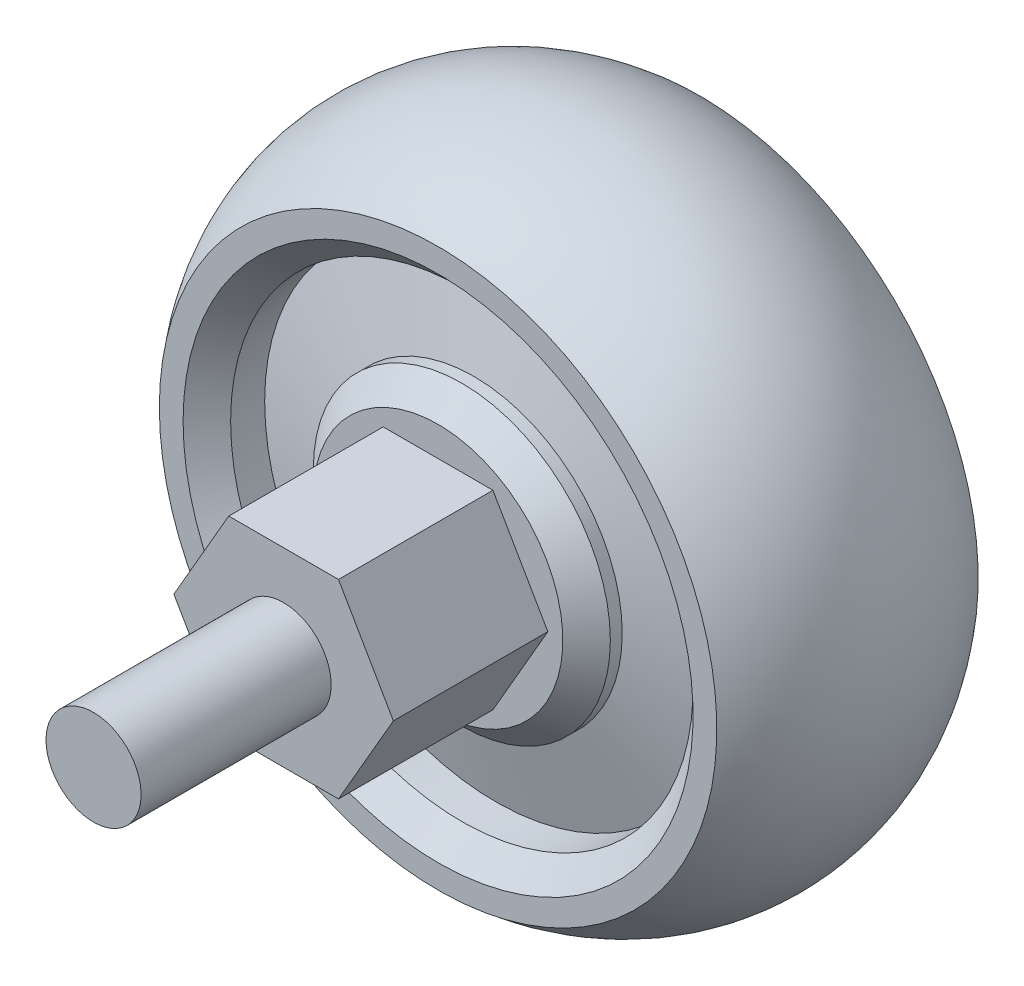
ISO-10303-21;
HEADER;
FILE_DESCRIPTION(('STEP AP214'),'2;1');
FILE_NAME('part.step','',(''),(''),'','','');
FILE_SCHEMA(('AUTOMOTIVE_DESIGN { 1 0 10303 214 1 1 1 1 }'));
ENDSEC;
DATA;
#1=APPLICATION_CONTEXT('core data for automotive mechanical design processes');
#2=APPLICATION_PROTOCOL_DEFINITION('international standard','automotive_design',2000,#1);
#3=PRODUCT_CONTEXT('',#1,'mechanical');
#4=PRODUCT('Part','Part','',(#3));
#5=PRODUCT_RELATED_PRODUCT_CATEGORY('part','',(#4));
#6=PRODUCT_DEFINITION_FORMATION('','',#4);
#7=PRODUCT_DEFINITION_CONTEXT('part definition',#1,'design');
#8=PRODUCT_DEFINITION('design','',#6,#7);
#9=PRODUCT_DEFINITION_SHAPE('','',#8);
#10=(LENGTH_UNIT() NAMED_UNIT(*) SI_UNIT(.MILLI.,.METRE.));
#11=(NAMED_UNIT(*) PLANE_ANGLE_UNIT() SI_UNIT($,.RADIAN.));
#12=(NAMED_UNIT(*) SI_UNIT($,.STERADIAN.) SOLID_ANGLE_UNIT());
#13=UNCERTAINTY_MEASURE_WITH_UNIT(LENGTH_MEASURE(1.E-05),#10,'distance_accuracy_value','');
#14=(GEOMETRIC_REPRESENTATION_CONTEXT(3) GLOBAL_UNCERTAINTY_ASSIGNED_CONTEXT((#13)) GLOBAL_UNIT_ASSIGNED_CONTEXT((#10,
#11,#12)) REPRESENTATION_CONTEXT('',''));
#15=CARTESIAN_POINT('',(0.,0.,0.));
#16=DIRECTION('',(0.,0.,1.));
#17=DIRECTION('',(1.,0.,0.));
#18=AXIS2_PLACEMENT_3D('',#15,#16,#17);
#19=CARTESIAN_POINT('',(0.,0.,7.79103938563071));
#20=DIRECTION('',(0.,0.,-1.));
#21=DIRECTION('',(-1.,0.,0.));
#22=AXIS2_PLACEMENT_3D('',#19,#20,#21);
#23=CONICAL_SURFACE('',#22,24.716081373956,1.30899693899575);
#24=CARTESIAN_POINT('',(0.,0.,10.16));
#25=DIRECTION('',(0.,0.,-1.));
#26=DIRECTION('',(-1.,0.,0.));
#27=AXIS2_PLACEMENT_3D('',#24,#25,#26);
#28=CIRCLE('',#27,15.875);
#29=CARTESIAN_POINT('',(-15.875,0.,10.16));
#30=VERTEX_POINT('',#29);
#31=EDGE_CURVE('E128',#30,#30,#28,.T.);
#32=ORIENTED_EDGE('',*,*,#31,.T.);
#33=EDGE_LOOP('',(#32));
#34=FACE_BOUND('',#33,.T.);
#35=CARTESIAN_POINT('',(0.,0.,7.79103938563071));
#36=DIRECTION('',(0.,0.,-1.));
#37=DIRECTION('',(-1.,0.,0.));
#38=AXIS2_PLACEMENT_3D('',#35,#36,#37);
#39=CIRCLE('',#38,24.716081373956);
#40=CARTESIAN_POINT('',(-24.716081373956,0.,7.79103938563071));
#41=VERTEX_POINT('',#40);
#42=EDGE_CURVE('E131',#41,#41,#39,.T.);
#43=ORIENTED_EDGE('',*,*,#42,.F.);
#44=EDGE_LOOP('',(#43));
#45=FACE_BOUND('',#44,.T.);
#46=ADVANCED_FACE('F16',(#34,#45),#23,.T.);
#47=CARTESIAN_POINT('',(0.,0.,0.));
#48=DIRECTION('',(0.,0.,-1.));
#49=DIRECTION('',(-1.,0.,0.));
#50=AXIS2_PLACEMENT_3D('',#47,#48,#49);
#51=CYLINDRICAL_SURFACE('',#50,15.875);
#52=CARTESIAN_POINT('',(0.,0.,11.43));
#53=DIRECTION('',(0.,0.,-1.));
#54=DIRECTION('',(-1.,0.,0.));
#55=AXIS2_PLACEMENT_3D('',#52,#53,#54);
#56=CIRCLE('',#55,15.875);
#57=CARTESIAN_POINT('',(-15.875,0.,11.43));
#58=VERTEX_POINT('',#57);
#59=EDGE_CURVE('E11',#58,#58,#56,.T.);
#60=ORIENTED_EDGE('',*,*,#59,.T.);
#61=EDGE_LOOP('',(#60));
#62=FACE_BOUND('',#61,.T.);
#63=ORIENTED_EDGE('',*,*,#31,.F.);
#64=EDGE_LOOP('',(#63));
#65=FACE_BOUND('',#64,.T.);
#66=ADVANCED_FACE('F171',(#62,#65),#51,.T.);
#67=CARTESIAN_POINT('',(0.,0.,0.));
#68=DIRECTION('',(0.,0.,-1.));
#69=DIRECTION('',(-1.,0.,0.));
#70=AXIS2_PLACEMENT_3D('',#67,#68,#69);
#71=CYLINDRICAL_SURFACE('',#70,24.716081373956);
#72=CARTESIAN_POINT('',(0.,0.,-11.43));
#73=DIRECTION('',(0.,0.,1.));
#74=DIRECTION('',(1.,0.,0.));
#75=AXIS2_PLACEMENT_3D('',#72,#73,#74);
#76=CIRCLE('',#75,24.716081373956);
#77=CARTESIAN_POINT('',(24.716081373956,0.,-11.43));
#78=VERTEX_POINT('',#77);
#79=EDGE_CURVE('E137',#78,#78,#76,.F.);
#80=ORIENTED_EDGE('',*,*,#79,.T.);
#81=EDGE_LOOP('',(#80));
#82=FACE_BOUND('',#81,.T.);
#83=CARTESIAN_POINT('',(0.,0.,-7.79103938563071));
#84=DIRECTION('',(0.,0.,1.));
#85=DIRECTION('',(1.,0.,0.));
#86=AXIS2_PLACEMENT_3D('',#83,#84,#85);
#87=CIRCLE('',#86,24.716081373956);
#88=CARTESIAN_POINT('',(24.716081373956,0.,-7.79103938563071));
#89=VERTEX_POINT('',#88);
#90=EDGE_CURVE('E119',#89,#89,#87,.F.);
#91=ORIENTED_EDGE('',*,*,#90,.F.);
#92=EDGE_LOOP('',(#91));
#93=FACE_BOUND('',#92,.T.);
#94=ADVANCED_FACE('F178',(#82,#93),#71,.F.);
#95=CARTESIAN_POINT('',(0.,0.,0.));
#96=DIRECTION('',(0.,0.,-1.));
#97=DIRECTION('',(-1.,0.,0.));
#98=AXIS2_PLACEMENT_3D('',#95,#96,#97);
#99=DEGENERATE_TOROIDAL_SURFACE('',#98,13.335,21.59,.T.);
#100=CARTESIAN_POINT('',(0.,0.,-13.97));
#101=DIRECTION('',(0.,0.,-1.));
#102=DIRECTION('',(-1.,0.,0.));
#103=AXIS2_PLACEMENT_3D('',#100,#101,#102);
#104=CIRCLE('',#103,29.7960813739559);
#105=CARTESIAN_POINT('',(-29.7960813739559,0.,-13.97));
#106=VERTEX_POINT('',#105);
#107=EDGE_CURVE('E98',#106,#106,#104,.T.);
#108=ORIENTED_EDGE('',*,*,#107,.F.);
#109=EDGE_LOOP('',(#108));
#110=FACE_BOUND('',#109,.T.);
#111=CARTESIAN_POINT('',(0.,0.,13.97));
#112=DIRECTION('',(0.,0.,-1.));
#113=DIRECTION('',(-1.,0.,0.));
#114=AXIS2_PLACEMENT_3D('',#111,#112,#113);
#115=CIRCLE('',#114,29.7960813739559);
#116=CARTESIAN_POINT('',(-29.7960813739559,0.,13.97));
#117=VERTEX_POINT('',#116);
#118=EDGE_CURVE('E116',#117,#117,#115,.T.);
#119=ORIENTED_EDGE('',*,*,#118,.T.);
#120=EDGE_LOOP('',(#119));
#121=FACE_BOUND('',#120,.T.);
#122=ADVANCED_FACE('F221',(#110,#121),#99,.T.);
#123=CARTESIAN_POINT('',(0.,0.,13.97));
#124=DIRECTION('',(0.,0.,-1.));
#125=DIRECTION('',(-1.,0.,0.));
#126=AXIS2_PLACEMENT_3D('',#123,#124,#125);
#127=PLANE('',#126);
#128=CARTESIAN_POINT('',(0.,0.,13.97));
#129=DIRECTION('',(0.,0.,-1.));
#130=DIRECTION('',(-1.,0.,0.));
#131=AXIS2_PLACEMENT_3D('',#128,#129,#130);
#132=CIRCLE('',#131,27.2560813739559);
#133=CARTESIAN_POINT('',(-27.2560813739559,0.,13.97));
#134=VERTEX_POINT('',#133);
#135=EDGE_CURVE('E149',#134,#134,#132,.T.);
#136=ORIENTED_EDGE('',*,*,#135,.T.);
#137=EDGE_LOOP('',(#136));
#138=FACE_BOUND('',#137,.T.);
#139=ORIENTED_EDGE('',*,*,#118,.F.);
#140=EDGE_LOOP('',(#139));
#141=FACE_BOUND('',#140,.T.);
#142=ADVANCED_FACE('F270',(#138,#141),#127,.F.);
#143=CARTESIAN_POINT('',(0.,0.,11.43));
#144=DIRECTION('',(0.,0.,-1.));
#145=DIRECTION('',(-1.,0.,0.));
#146=AXIS2_PLACEMENT_3D('',#143,#144,#145);
#147=CIRCLE('',#146,24.716081373956);
#148=CARTESIAN_POINT('',(-24.716081373956,0.,11.43));
#149=VERTEX_POINT('',#148);
#150=EDGE_CURVE('E152',#149,#149,#147,.F.);
#151=ORIENTED_EDGE('',*,*,#150,.T.);
#152=EDGE_LOOP('',(#151));
#153=FACE_BOUND('',#152,.T.);
#154=ORIENTED_EDGE('',*,*,#42,.T.);
#155=EDGE_LOOP('',(#154));
#156=FACE_BOUND('',#155,.T.);
#157=ADVANCED_FACE('F216',(#153,#156),#71,.F.);
#158=CARTESIAN_POINT('',(0.,0.,-13.97));
#159=DIRECTION('',(0.,0.,1.));
#160=DIRECTION('',(1.,0.,0.));
#161=AXIS2_PLACEMENT_3D('',#158,#159,#160);
#162=PLANE('',#161);
#163=CARTESIAN_POINT('',(0.,0.,-13.97));
#164=DIRECTION('',(0.,0.,1.));
#165=DIRECTION('',(1.,0.,0.));
#166=AXIS2_PLACEMENT_3D('',#163,#164,#165);
#167=CIRCLE('',#166,27.2560813739559);
#168=CARTESIAN_POINT('',(27.2560813739559,0.,-13.97));
#169=VERTEX_POINT('',#168);
#170=EDGE_CURVE('E140',#169,#169,#167,.T.);
#171=ORIENTED_EDGE('',*,*,#170,.T.);
#172=EDGE_LOOP('',(#171));
#173=FACE_BOUND('',#172,.T.);
#174=ORIENTED_EDGE('',*,*,#107,.T.);
#175=EDGE_LOOP('',(#174));
#176=FACE_BOUND('',#175,.T.);
#177=ADVANCED_FACE('F209',(#173,#176),#162,.F.);
#178=CARTESIAN_POINT('',(0.,0.,-13.97));
#179=DIRECTION('',(0.,0.,-1.));
#180=DIRECTION('',(-1.,0.,0.));
#181=AXIS2_PLACEMENT_3D('',#178,#179,#180);
#182=PLANE('',#181);
#183=CARTESIAN_POINT('',(0.,0.,-13.97));
#184=DIRECTION('',(0.,0.,-1.));
#185=DIRECTION('',(-1.,0.,0.));
#186=AXIS2_PLACEMENT_3D('',#183,#184,#185);
#187=CIRCLE('',#186,13.335);
#188=CARTESIAN_POINT('',(-13.335,0.,-13.97));
#189=VERTEX_POINT('',#188);
#190=EDGE_CURVE('E143',#189,#189,#187,.T.);
#191=ORIENTED_EDGE('',*,*,#190,.T.);
#192=EDGE_LOOP('',(#191));
#193=FACE_BOUND('',#192,.T.);
#194=ADVANCED_FACE('F191',(#193),#182,.T.);
#195=CARTESIAN_POINT('',(0.,0.,0.));
#196=DIRECTION('',(0.,0.,-1.));
#197=DIRECTION('',(-1.,0.,0.));
#198=AXIS2_PLACEMENT_3D('',#195,#196,#197);
#199=CYLINDRICAL_SURFACE('',#198,15.875);
#200=CARTESIAN_POINT('',(0.,0.,-11.43));
#201=DIRECTION('',(0.,0.,-1.));
#202=DIRECTION('',(-1.,0.,0.));
#203=AXIS2_PLACEMENT_3D('',#200,#201,#202);
#204=CIRCLE('',#203,15.875);
#205=CARTESIAN_POINT('',(-15.875,0.,-11.43));
#206=VERTEX_POINT('',#205);
#207=EDGE_CURVE('E146',#206,#206,#204,.F.);
#208=ORIENTED_EDGE('',*,*,#207,.T.);
#209=EDGE_LOOP('',(#208));
#210=FACE_BOUND('',#209,.T.);
#211=CARTESIAN_POINT('',(0.,0.,-10.16));
#212=DIRECTION('',(0.,0.,-1.));
#213=DIRECTION('',(-1.,0.,0.));
#214=AXIS2_PLACEMENT_3D('',#211,#212,#213);
#215=CIRCLE('',#214,15.875);
#216=CARTESIAN_POINT('',(-15.875,0.,-10.16));
#217=VERTEX_POINT('',#216);
#218=EDGE_CURVE('E134',#217,#217,#215,.T.);
#219=ORIENTED_EDGE('',*,*,#218,.T.);
#220=EDGE_LOOP('',(#219));
#221=FACE_BOUND('',#220,.T.);
#222=ADVANCED_FACE('F187',(#210,#221),#199,.T.);
#223=CARTESIAN_POINT('',(0.,0.,-10.16));
#224=DIRECTION('',(0.,0.,1.));
#225=DIRECTION('',(1.,0.,0.));
#226=AXIS2_PLACEMENT_3D('',#223,#224,#225);
#227=CONICAL_SURFACE('',#226,15.875,1.30899693899575);
#228=ORIENTED_EDGE('',*,*,#90,.T.);
#229=EDGE_LOOP('',(#228));
#230=FACE_BOUND('',#229,.T.);
#231=ORIENTED_EDGE('',*,*,#218,.F.);
#232=EDGE_LOOP('',(#231));
#233=FACE_BOUND('',#232,.T.);
#234=ADVANCED_FACE('F184',(#230,#233),#227,.T.);
#235=CARTESIAN_POINT('',(5.86587873496661,10.16,-30.9312806053458));
#236=DIRECTION('',(0.,1.,0.));
#237=DIRECTION('',(0.,0.,1.));
#238=AXIS2_PLACEMENT_3D('',#235,#236,#237);
#239=PLANE('',#238);
#240=DIRECTION('',(-1.,0.,0.));
#241=VECTOR('',#240,1.);
#242=CARTESIAN_POINT('',(5.86587873496661,10.16,13.97));
#243=LINE('',#242,#241);
#244=CARTESIAN_POINT('',(5.86587873496661,10.16,13.97));
#245=VERTEX_POINT('',#244);
#246=CARTESIAN_POINT('',(-5.8658787349666,10.16,13.97));
#247=VERTEX_POINT('',#246);
#248=EDGE_CURVE('E81',#245,#247,#243,.T.);
#249=ORIENTED_EDGE('',*,*,#248,.T.);
#250=DIRECTION('',(0.,0.,1.));
#251=VECTOR('',#250,1.);
#252=CARTESIAN_POINT('',(-5.8658787349666,10.16,-30.9312806053458));
#253=LINE('',#252,#251);
#254=CARTESIAN_POINT('',(-5.8658787349666,10.16,30.48));
#255=VERTEX_POINT('',#254);
#256=EDGE_CURVE('E68',#247,#255,#253,.T.);
#257=ORIENTED_EDGE('',*,*,#256,.T.);
#258=DIRECTION('',(-1.,0.,0.));
#259=VECTOR('',#258,1.);
#260=CARTESIAN_POINT('',(5.86587873496661,10.16,30.48));
#261=LINE('',#260,#259);
#262=CARTESIAN_POINT('',(5.86587873496661,10.16,30.48));
#263=VERTEX_POINT('',#262);
#264=EDGE_CURVE('E92',#263,#255,#261,.T.);
#265=ORIENTED_EDGE('',*,*,#264,.F.);
#266=DIRECTION('',(0.,0.,1.));
#267=VECTOR('',#266,1.);
#268=CARTESIAN_POINT('',(5.86587873496661,10.16,-30.9312806053458));
#269=LINE('',#268,#267);
#270=EDGE_CURVE('E86',#245,#263,#269,.T.);
#271=ORIENTED_EDGE('',*,*,#270,.F.);
#272=EDGE_LOOP('',(#249,#257,#265,#271));
#273=FACE_BOUND('',#272,.T.);
#274=ADVANCED_FACE('F85',(#273),#239,.T.);
#275=CARTESIAN_POINT('',(11.7317574699332,0.,-30.9312806053458));
#276=DIRECTION('',(0.866025403784439,0.5,0.));
#277=DIRECTION('',(-0.5,0.866025403784439,0.));
#278=AXIS2_PLACEMENT_3D('',#275,#276,#277);
#279=PLANE('',#278);
#280=DIRECTION('',(-0.5,0.866025403784439,0.));
#281=VECTOR('',#280,1.);
#282=CARTESIAN_POINT('',(11.7317574699332,0.,13.97));
#283=LINE('',#282,#281);
#284=CARTESIAN_POINT('',(11.7317574699332,0.,13.97));
#285=VERTEX_POINT('',#284);
#286=EDGE_CURVE('E88',#285,#245,#283,.T.);
#287=ORIENTED_EDGE('',*,*,#286,.T.);
#288=ORIENTED_EDGE('',*,*,#270,.T.);
#289=DIRECTION('',(-0.5,0.866025403784439,0.));
#290=VECTOR('',#289,1.);
#291=CARTESIAN_POINT('',(11.7317574699332,0.,30.48));
#292=LINE('',#291,#290);
#293=CARTESIAN_POINT('',(11.7317574699332,0.,30.48));
#294=VERTEX_POINT('',#293);
#295=EDGE_CURVE('E106',#294,#263,#292,.T.);
#296=ORIENTED_EDGE('',*,*,#295,.F.);
#297=DIRECTION('',(0.,0.,1.));
#298=VECTOR('',#297,1.);
#299=CARTESIAN_POINT('',(11.7317574699332,0.,-30.9312806053458));
#300=LINE('',#299,#298);
#301=EDGE_CURVE('E104',#285,#294,#300,.T.);
#302=ORIENTED_EDGE('',*,*,#301,.F.);
#303=EDGE_LOOP('',(#287,#288,#296,#302));
#304=FACE_BOUND('',#303,.T.);
#305=ADVANCED_FACE('F255',(#304),#279,.T.);
#306=CARTESIAN_POINT('',(5.8658787349666,-10.16,-30.9312806053458));
#307=DIRECTION('',(0.866025403784439,-0.5,0.));
#308=DIRECTION('',(0.5,0.866025403784439,0.));
#309=AXIS2_PLACEMENT_3D('',#306,#307,#308);
#310=PLANE('',#309);
#311=DIRECTION('',(0.5,0.866025403784439,0.));
#312=VECTOR('',#311,1.);
#313=CARTESIAN_POINT('',(5.8658787349666,-10.16,13.97));
#314=LINE('',#313,#312);
#315=CARTESIAN_POINT('',(5.8658787349666,-10.16,13.97));
#316=VERTEX_POINT('',#315);
#317=EDGE_CURVE('E95',#316,#285,#314,.T.);
#318=ORIENTED_EDGE('',*,*,#317,.T.);
#319=ORIENTED_EDGE('',*,*,#301,.T.);
#320=DIRECTION('',(0.5,0.866025403784439,0.));
#321=VECTOR('',#320,1.);
#322=CARTESIAN_POINT('',(5.8658787349666,-10.16,30.48));
#323=LINE('',#322,#321);
#324=CARTESIAN_POINT('',(5.8658787349666,-10.16,30.48));
#325=VERTEX_POINT('',#324);
#326=EDGE_CURVE('E109',#325,#294,#323,.T.);
#327=ORIENTED_EDGE('',*,*,#326,.F.);
#328=DIRECTION('',(0.,0.,1.));
#329=VECTOR('',#328,1.);
#330=CARTESIAN_POINT('',(5.8658787349666,-10.16,-30.9312806053458));
#331=LINE('',#330,#329);
#332=EDGE_CURVE('E107',#316,#325,#331,.T.);
#333=ORIENTED_EDGE('',*,*,#332,.F.);
#334=EDGE_LOOP('',(#318,#319,#327,#333));
#335=FACE_BOUND('',#334,.T.);
#336=ADVANCED_FACE('F254',(#335),#310,.T.);
#337=CARTESIAN_POINT('',(-5.8658787349666,-10.16,-30.9312806053458));
#338=DIRECTION('',(0.,-1.,0.));
#339=DIRECTION('',(1.,0.,0.));
#340=AXIS2_PLACEMENT_3D('',#337,#338,#339);
#341=PLANE('',#340);
#342=DIRECTION('',(1.,0.,0.));
#343=VECTOR('',#342,1.);
#344=CARTESIAN_POINT('',(-5.8658787349666,-10.16,13.97));
#345=LINE('',#344,#343);
#346=CARTESIAN_POINT('',(-5.8658787349666,-10.16,13.97));
#347=VERTEX_POINT('',#346);
#348=EDGE_CURVE('E99',#347,#316,#345,.T.);
#349=ORIENTED_EDGE('',*,*,#348,.T.);
#350=ORIENTED_EDGE('',*,*,#332,.T.);
#351=DIRECTION('',(1.,0.,0.));
#352=VECTOR('',#351,1.);
#353=CARTESIAN_POINT('',(-5.8658787349666,-10.16,30.48));
#354=LINE('',#353,#352);
#355=CARTESIAN_POINT('',(-5.8658787349666,-10.16,30.48));
#356=VERTEX_POINT('',#355);
#357=EDGE_CURVE('E112',#356,#325,#354,.T.);
#358=ORIENTED_EDGE('',*,*,#357,.F.);
#359=DIRECTION('',(0.,0.,1.));
#360=VECTOR('',#359,1.);
#361=CARTESIAN_POINT('',(-5.8658787349666,-10.16,-30.9312806053458));
#362=LINE('',#361,#360);
#363=EDGE_CURVE('E110',#347,#356,#362,.T.);
#364=ORIENTED_EDGE('',*,*,#363,.F.);
#365=EDGE_LOOP('',(#349,#350,#358,#364));
#366=FACE_BOUND('',#365,.T.);
#367=ADVANCED_FACE('F251',(#366),#341,.T.);
#368=CARTESIAN_POINT('',(-11.7317574699332,0.,-30.9312806053458));
#369=DIRECTION('',(-0.866025403784439,-0.5,0.));
#370=DIRECTION('',(0.5,-0.866025403784439,0.));
#371=AXIS2_PLACEMENT_3D('',#368,#369,#370);
#372=PLANE('',#371);
#373=DIRECTION('',(0.5,-0.866025403784439,0.));
#374=VECTOR('',#373,1.);
#375=CARTESIAN_POINT('',(-11.7317574699332,0.,13.97));
#376=LINE('',#375,#374);
#377=CARTESIAN_POINT('',(-11.7317574699332,0.,13.97));
#378=VERTEX_POINT('',#377);
#379=EDGE_CURVE('E83',#378,#347,#376,.T.);
#380=ORIENTED_EDGE('',*,*,#379,.T.);
#381=ORIENTED_EDGE('',*,*,#363,.T.);
#382=DIRECTION('',(0.5,-0.866025403784439,0.));
#383=VECTOR('',#382,1.);
#384=CARTESIAN_POINT('',(-11.7317574699332,0.,30.48));
#385=LINE('',#384,#383);
#386=CARTESIAN_POINT('',(-11.7317574699332,0.,30.48));
#387=VERTEX_POINT('',#386);
#388=EDGE_CURVE('E31',#387,#356,#385,.T.);
#389=ORIENTED_EDGE('',*,*,#388,.F.);
#390=DIRECTION('',(0.,0.,1.));
#391=VECTOR('',#390,1.);
#392=CARTESIAN_POINT('',(-11.7317574699332,0.,-30.9312806053458));
#393=LINE('',#392,#391);
#394=EDGE_CURVE('E35',#378,#387,#393,.T.);
#395=ORIENTED_EDGE('',*,*,#394,.F.);
#396=EDGE_LOOP('',(#380,#381,#389,#395));
#397=FACE_BOUND('',#396,.T.);
#398=ADVANCED_FACE('F446',(#397),#372,.T.);
#399=CARTESIAN_POINT('',(-5.8658787349666,10.16,-30.9312806053458));
#400=DIRECTION('',(-0.866025403784439,0.5,0.));
#401=DIRECTION('',(-0.5,-0.866025403784439,0.));
#402=AXIS2_PLACEMENT_3D('',#399,#400,#401);
#403=PLANE('',#402);
#404=DIRECTION('',(-0.5,-0.866025403784439,0.));
#405=VECTOR('',#404,1.);
#406=CARTESIAN_POINT('',(-5.8658787349666,10.16,13.97));
#407=LINE('',#406,#405);
#408=EDGE_CURVE('E71',#247,#378,#407,.T.);
#409=ORIENTED_EDGE('',*,*,#408,.T.);
#410=ORIENTED_EDGE('',*,*,#394,.T.);
#411=DIRECTION('',(-0.5,-0.866025403784439,0.));
#412=VECTOR('',#411,1.);
#413=CARTESIAN_POINT('',(-5.8658787349666,10.16,30.48));
#414=LINE('',#413,#412);
#415=EDGE_CURVE('E73',#255,#387,#414,.T.);
#416=ORIENTED_EDGE('',*,*,#415,.F.);
#417=ORIENTED_EDGE('',*,*,#256,.F.);
#418=EDGE_LOOP('',(#409,#410,#416,#417));
#419=FACE_BOUND('',#418,.T.);
#420=ADVANCED_FACE('F70',(#419),#403,.T.);
#421=CARTESIAN_POINT('',(0.,0.,13.97));
#422=DIRECTION('',(0.,0.,-1.));
#423=DIRECTION('',(-1.,0.,0.));
#424=AXIS2_PLACEMENT_3D('',#421,#422,#423);
#425=PLANE('',#424);
#426=CARTESIAN_POINT('',(0.,0.,13.97));
#427=DIRECTION('',(0.,0.,-1.));
#428=DIRECTION('',(-1.,0.,0.));
#429=AXIS2_PLACEMENT_3D('',#426,#427,#428);
#430=CIRCLE('',#429,13.335);
#431=CARTESIAN_POINT('',(-13.335,0.,13.97));
#432=VERTEX_POINT('',#431);
#433=EDGE_CURVE('E24',#432,#432,#430,.F.);
#434=ORIENTED_EDGE('',*,*,#433,.T.);
#435=EDGE_LOOP('',(#434));
#436=FACE_BOUND('',#435,.T.);
#437=ORIENTED_EDGE('',*,*,#286,.F.);
#438=ORIENTED_EDGE('',*,*,#317,.F.);
#439=ORIENTED_EDGE('',*,*,#348,.F.);
#440=ORIENTED_EDGE('',*,*,#379,.F.);
#441=ORIENTED_EDGE('',*,*,#408,.F.);
#442=ORIENTED_EDGE('',*,*,#248,.F.);
#443=EDGE_LOOP('',(#437,#438,#439,#440,#441,#442));
#444=FACE_BOUND('',#443,.T.);
#445=ADVANCED_FACE('F80',(#436,#444),#425,.F.);
#446=CARTESIAN_POINT('',(0.,0.,50.8));
#447=DIRECTION('',(0.,0.,1.));
#448=DIRECTION('',(1.,0.,0.));
#449=AXIS2_PLACEMENT_3D('',#446,#447,#448);
#450=PLANE('',#449);
#451=CARTESIAN_POINT('',(0.,0.,50.8));
#452=DIRECTION('',(0.,0.,-1.));
#453=DIRECTION('',(-1.,0.,0.));
#454=AXIS2_PLACEMENT_3D('',#451,#452,#453);
#455=CIRCLE('',#454,5.08);
#456=CARTESIAN_POINT('',(-5.08,0.,50.8));
#457=VERTEX_POINT('',#456);
#458=EDGE_CURVE('E122',#457,#457,#455,.T.);
#459=ORIENTED_EDGE('',*,*,#458,.F.);
#460=EDGE_LOOP('',(#459));
#461=FACE_BOUND('',#460,.T.);
#462=ADVANCED_FACE('F223',(#461),#450,.T.);
#463=CARTESIAN_POINT('',(0.,0.,0.));
#464=DIRECTION('',(0.,0.,-1.));
#465=DIRECTION('',(-1.,0.,0.));
#466=AXIS2_PLACEMENT_3D('',#463,#464,#465);
#467=CYLINDRICAL_SURFACE('',#466,5.08);
#468=ORIENTED_EDGE('',*,*,#458,.T.);
#469=EDGE_LOOP('',(#468));
#470=FACE_BOUND('',#469,.T.);
#471=CARTESIAN_POINT('',(0.,0.,30.48));
#472=DIRECTION('',(0.,0.,-1.));
#473=DIRECTION('',(-1.,0.,0.));
#474=AXIS2_PLACEMENT_3D('',#471,#472,#473);
#475=CIRCLE('',#474,5.08);
#476=CARTESIAN_POINT('',(-5.08,0.,30.48));
#477=VERTEX_POINT('',#476);
#478=EDGE_CURVE('E125',#477,#477,#475,.T.);
#479=ORIENTED_EDGE('',*,*,#478,.F.);
#480=EDGE_LOOP('',(#479));
#481=FACE_BOUND('',#480,.T.);
#482=ADVANCED_FACE('F226',(#470,#481),#467,.T.);
#483=CARTESIAN_POINT('',(0.,0.,30.48));
#484=DIRECTION('',(0.,0.,1.));
#485=DIRECTION('',(1.,0.,0.));
#486=AXIS2_PLACEMENT_3D('',#483,#484,#485);
#487=PLANE('',#486);
#488=ORIENTED_EDGE('',*,*,#478,.T.);
#489=EDGE_LOOP('',(#488));
#490=FACE_BOUND('',#489,.T.);
#491=ORIENTED_EDGE('',*,*,#295,.T.);
#492=ORIENTED_EDGE('',*,*,#264,.T.);
#493=ORIENTED_EDGE('',*,*,#415,.T.);
#494=ORIENTED_EDGE('',*,*,#388,.T.);
#495=ORIENTED_EDGE('',*,*,#357,.T.);
#496=ORIENTED_EDGE('',*,*,#326,.T.);
#497=EDGE_LOOP('',(#491,#492,#493,#494,#495,#496));
#498=FACE_BOUND('',#497,.T.);
#499=ADVANCED_FACE('F196',(#490,#498),#487,.T.);
#500=CARTESIAN_POINT('',(0.,0.,-11.43));
#501=DIRECTION('',(0.,0.,-1.));
#502=DIRECTION('',(-1.,0.,0.));
#503=AXIS2_PLACEMENT_3D('',#500,#501,#502);
#504=CONICAL_SURFACE('',#503,24.716081373956,0.78539816339745);
#505=ORIENTED_EDGE('',*,*,#170,.F.);
#506=EDGE_LOOP('',(#505));
#507=FACE_BOUND('',#506,.T.);
#508=ORIENTED_EDGE('',*,*,#79,.F.);
#509=EDGE_LOOP('',(#508));
#510=FACE_BOUND('',#509,.T.);
#511=ADVANCED_FACE('F193',(#507,#510),#504,.F.);
#512=CARTESIAN_POINT('',(0.,0.,-13.97));
#513=DIRECTION('',(0.,0.,1.));
#514=DIRECTION('',(1.,0.,0.));
#515=AXIS2_PLACEMENT_3D('',#512,#513,#514);
#516=CONICAL_SURFACE('',#515,13.335,0.785398163397448);
#517=ORIENTED_EDGE('',*,*,#207,.F.);
#518=EDGE_LOOP('',(#517));
#519=FACE_BOUND('',#518,.T.);
#520=ORIENTED_EDGE('',*,*,#190,.F.);
#521=EDGE_LOOP('',(#520));
#522=FACE_BOUND('',#521,.T.);
#523=ADVANCED_FACE('F167',(#519,#522),#516,.T.);
#524=CARTESIAN_POINT('',(0.,0.,13.97));
#525=DIRECTION('',(0.,0.,1.));
#526=DIRECTION('',(1.,0.,0.));
#527=AXIS2_PLACEMENT_3D('',#524,#525,#526);
#528=CONICAL_SURFACE('',#527,27.2560813739559,0.785398163397446);
#529=ORIENTED_EDGE('',*,*,#150,.F.);
#530=EDGE_LOOP('',(#529));
#531=FACE_BOUND('',#530,.T.);
#532=ORIENTED_EDGE('',*,*,#135,.F.);
#533=EDGE_LOOP('',(#532));
#534=FACE_BOUND('',#533,.T.);
#535=ADVANCED_FACE('F159',(#531,#534),#528,.F.);
#536=CARTESIAN_POINT('',(0.,0.,13.97));
#537=DIRECTION('',(0.,0.,-1.));
#538=DIRECTION('',(-1.,0.,0.));
#539=AXIS2_PLACEMENT_3D('',#536,#537,#538);
#540=CONICAL_SURFACE('',#539,13.335,0.785398163397444);
#541=ORIENTED_EDGE('',*,*,#59,.F.);
#542=EDGE_LOOP('',(#541));
#543=FACE_BOUND('',#542,.T.);
#544=ORIENTED_EDGE('',*,*,#433,.F.);
#545=EDGE_LOOP('',(#544));
#546=FACE_BOUND('',#545,.T.);
#547=ADVANCED_FACE('F18',(#543,#546),#540,.T.);
#548=CLOSED_SHELL('',(#46,#66,#94,#122,#142,#157,#177,#194,#222,#234,#274,#305,#336,#367,#398,
#420,#445,#462,#482,#499,#511,#523,#535,#547));
#549=MANIFOLD_SOLID_BREP('B1',#548);
#550=ADVANCED_BREP_SHAPE_REPRESENTATION('',(#18,#549),#14);
#551=SHAPE_DEFINITION_REPRESENTATION(#9,#550);
ENDSEC;
END-ISO-10303-21;
